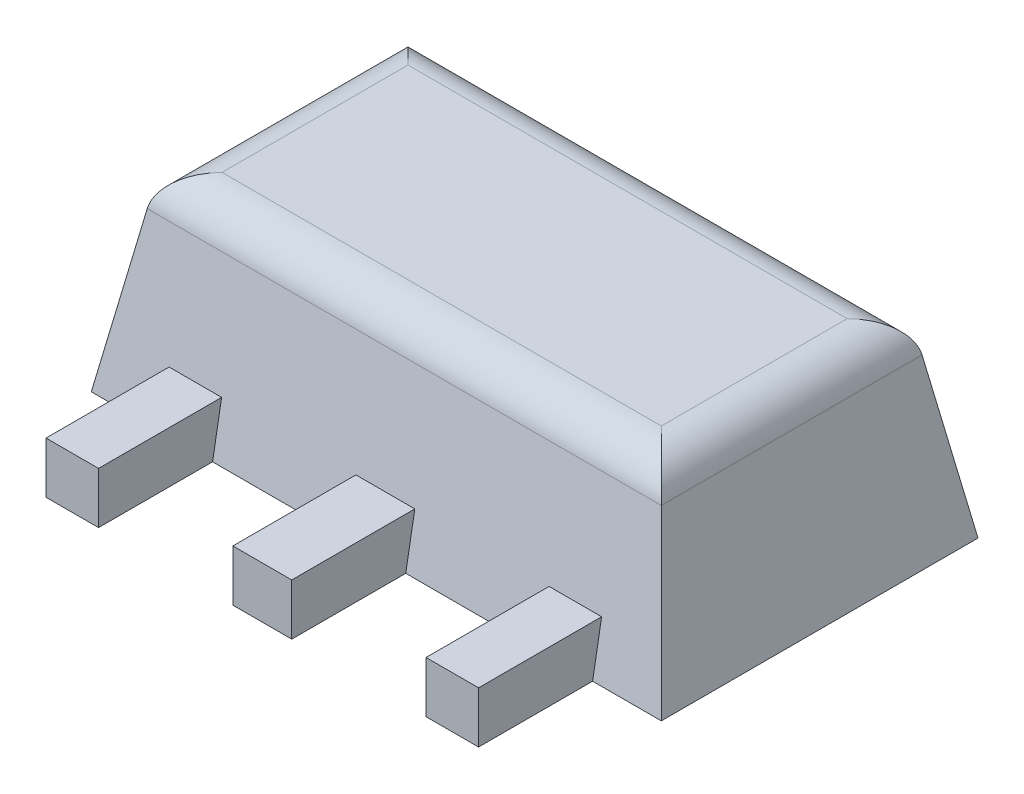
ISO-10303-21;
HEADER;
FILE_DESCRIPTION(('STEP AP214'),'2;1');
FILE_NAME('part.step','',(''),(''),'','','');
FILE_SCHEMA(('AUTOMOTIVE_DESIGN { 1 0 10303 214 1 1 1 1 }'));
ENDSEC;
DATA;
#1=APPLICATION_CONTEXT('core data for automotive mechanical design processes');
#2=APPLICATION_PROTOCOL_DEFINITION('international standard','automotive_design',2000,#1);
#3=PRODUCT_CONTEXT('',#1,'mechanical');
#4=PRODUCT('Part','Part','',(#3));
#5=PRODUCT_RELATED_PRODUCT_CATEGORY('part','',(#4));
#6=PRODUCT_DEFINITION_FORMATION('','',#4);
#7=PRODUCT_DEFINITION_CONTEXT('part definition',#1,'design');
#8=PRODUCT_DEFINITION('design','',#6,#7);
#9=PRODUCT_DEFINITION_SHAPE('','',#8);
#10=(LENGTH_UNIT() NAMED_UNIT(*) SI_UNIT(.MILLI.,.METRE.));
#11=(NAMED_UNIT(*) PLANE_ANGLE_UNIT() SI_UNIT($,.RADIAN.));
#12=(NAMED_UNIT(*) SI_UNIT($,.STERADIAN.) SOLID_ANGLE_UNIT());
#13=UNCERTAINTY_MEASURE_WITH_UNIT(LENGTH_MEASURE(1.E-05),#10,'distance_accuracy_value','');
#14=(GEOMETRIC_REPRESENTATION_CONTEXT(3) GLOBAL_UNCERTAINTY_ASSIGNED_CONTEXT((#13)) GLOBAL_UNIT_ASSIGNED_CONTEXT((#10,
#11,#12)) REPRESENTATION_CONTEXT('',''));
#15=CARTESIAN_POINT('',(0.,0.,0.));
#16=DIRECTION('',(0.,0.,1.));
#17=DIRECTION('',(1.,0.,0.));
#18=AXIS2_PLACEMENT_3D('',#15,#16,#17);
#19=CARTESIAN_POINT('',(-0.2075,1.5,0.45));
#20=DIRECTION('',(0.,0.,-1.));
#21=DIRECTION('',(-1.,0.,0.));
#22=AXIS2_PLACEMENT_3D('',#19,#20,#21);
#23=PLANE('',#22);
#24=DIRECTION('',(0.,-1.,0.));
#25=VECTOR('',#24,1.);
#26=CARTESIAN_POINT('',(0.2075,1.5,0.45));
#27=LINE('',#26,#25);
#28=CARTESIAN_POINT('',(0.2075,0.405,0.450000000000001));
#29=VERTEX_POINT('',#28);
#30=CARTESIAN_POINT('',(0.2075,0.,0.45));
#31=VERTEX_POINT('',#30);
#32=EDGE_CURVE('E241',#29,#31,#27,.T.);
#33=ORIENTED_EDGE('',*,*,#32,.F.);
#34=DIRECTION('',(1.,0.,0.));
#35=VECTOR('',#34,1.);
#36=CARTESIAN_POINT('',(-0.75,0.405,0.450000000000001));
#37=LINE('',#36,#35);
#38=CARTESIAN_POINT('',(-0.2075,0.405,0.450000000000001));
#39=VERTEX_POINT('',#38);
#40=EDGE_CURVE('E274',#39,#29,#37,.T.);
#41=ORIENTED_EDGE('',*,*,#40,.F.);
#42=DIRECTION('',(0.,-1.,0.));
#43=VECTOR('',#42,1.);
#44=CARTESIAN_POINT('',(-0.2075,1.5,0.45));
#45=LINE('',#44,#43);
#46=CARTESIAN_POINT('',(-0.2075,0.,0.45));
#47=VERTEX_POINT('',#46);
#48=EDGE_CURVE('E291',#39,#47,#45,.T.);
#49=ORIENTED_EDGE('',*,*,#48,.T.);
#50=DIRECTION('',(1.,0.,0.));
#51=VECTOR('',#50,1.);
#52=CARTESIAN_POINT('',(-0.2075,0.,0.45));
#53=LINE('',#52,#51);
#54=EDGE_CURVE('E421',#47,#31,#53,.T.);
#55=ORIENTED_EDGE('',*,*,#54,.T.);
#56=EDGE_LOOP('',(#33,#41,#49,#55));
#57=FACE_BOUND('',#56,.T.);
#58=ADVANCED_FACE('F33',(#57),#23,.F.);
#59=CARTESIAN_POINT('',(0.2075,1.5,0.45));
#60=DIRECTION('',(-1.,0.,0.));
#61=DIRECTION('',(0.,0.,1.));
#62=AXIS2_PLACEMENT_3D('',#59,#60,#61);
#63=PLANE('',#62);
#64=DIRECTION('',(0.,0.984807753012208,-0.173648177666931));
#65=VECTOR('',#64,1.);
#66=CARTESIAN_POINT('',(0.2075,1.30086040109288,-0.679376786847911));
#67=LINE('',#66,#65);
#68=CARTESIAN_POINT('',(0.2075,0.405,-0.521412427186928));
#69=VERTEX_POINT('',#68);
#70=CARTESIAN_POINT('',(0.2075,0.,-0.45));
#71=VERTEX_POINT('',#70);
#72=EDGE_CURVE('E244',#69,#71,#67,.F.);
#73=ORIENTED_EDGE('',*,*,#72,.F.);
#74=DIRECTION('',(0.,0.,1.));
#75=VECTOR('',#74,1.);
#76=CARTESIAN_POINT('',(0.2075,0.405,0.45));
#77=LINE('',#76,#75);
#78=EDGE_CURVE('E409',#69,#29,#77,.T.);
#79=ORIENTED_EDGE('',*,*,#78,.T.);
#80=ORIENTED_EDGE('',*,*,#32,.T.);
#81=DIRECTION('',(0.,0.,-1.));
#82=VECTOR('',#81,1.);
#83=CARTESIAN_POINT('',(0.2075,0.,0.45));
#84=LINE('',#83,#82);
#85=EDGE_CURVE('E457',#31,#71,#84,.T.);
#86=ORIENTED_EDGE('',*,*,#85,.T.);
#87=EDGE_LOOP('',(#73,#79,#80,#86));
#88=FACE_BOUND('',#87,.T.);
#89=ADVANCED_FACE('F360',(#88),#63,.F.);
#90=CARTESIAN_POINT('',(1.2675,1.5,-0.45));
#91=DIRECTION('',(1.,0.,0.));
#92=DIRECTION('',(0.,0.,-1.));
#93=AXIS2_PLACEMENT_3D('',#90,#91,#92);
#94=PLANE('',#93);
#95=DIRECTION('',(0.,-1.,0.));
#96=VECTOR('',#95,1.);
#97=CARTESIAN_POINT('',(1.2675,1.5,0.45));
#98=LINE('',#97,#96);
#99=CARTESIAN_POINT('',(1.2675,0.405,0.450000000000001));
#100=VERTEX_POINT('',#99);
#101=CARTESIAN_POINT('',(1.2675,0.,0.45));
#102=VERTEX_POINT('',#101);
#103=EDGE_CURVE('E237',#100,#102,#98,.T.);
#104=ORIENTED_EDGE('',*,*,#103,.F.);
#105=DIRECTION('',(0.,0.,-1.));
#106=VECTOR('',#105,1.);
#107=CARTESIAN_POINT('',(1.2675,0.405,-0.45));
#108=LINE('',#107,#106);
#109=CARTESIAN_POINT('',(1.2675,0.405,-0.521412427186928));
#110=VERTEX_POINT('',#109);
#111=EDGE_CURVE('E462',#100,#110,#108,.T.);
#112=ORIENTED_EDGE('',*,*,#111,.T.);
#113=DIRECTION('',(0.,0.984807753012208,-0.173648177666931));
#114=VECTOR('',#113,1.);
#115=CARTESIAN_POINT('',(1.2675,0.,-0.45));
#116=LINE('',#115,#114);
#117=CARTESIAN_POINT('',(1.2675,0.,-0.45));
#118=VERTEX_POINT('',#117);
#119=EDGE_CURVE('E240',#110,#118,#116,.F.);
#120=ORIENTED_EDGE('',*,*,#119,.T.);
#121=DIRECTION('',(0.,0.,1.));
#122=VECTOR('',#121,1.);
#123=CARTESIAN_POINT('',(1.2675,0.,-0.45));
#124=LINE('',#123,#122);
#125=EDGE_CURVE('E451',#118,#102,#124,.T.);
#126=ORIENTED_EDGE('',*,*,#125,.T.);
#127=EDGE_LOOP('',(#104,#112,#120,#126));
#128=FACE_BOUND('',#127,.T.);
#129=ADVANCED_FACE('F366',(#128),#94,.F.);
#130=CARTESIAN_POINT('',(1.2675,1.5,0.45));
#131=DIRECTION('',(0.,0.,-1.));
#132=DIRECTION('',(-1.,0.,0.));
#133=AXIS2_PLACEMENT_3D('',#130,#131,#132);
#134=PLANE('',#133);
#135=DIRECTION('',(0.,-1.,0.));
#136=VECTOR('',#135,1.);
#137=CARTESIAN_POINT('',(1.7325,1.5,0.45));
#138=LINE('',#137,#136);
#139=CARTESIAN_POINT('',(1.7325,0.405,0.45));
#140=VERTEX_POINT('',#139);
#141=CARTESIAN_POINT('',(1.7325,0.,0.45));
#142=VERTEX_POINT('',#141);
#143=EDGE_CURVE('E235',#140,#142,#138,.T.);
#144=ORIENTED_EDGE('',*,*,#143,.F.);
#145=EDGE_CURVE('E475',#100,#140,#37,.T.);
#146=ORIENTED_EDGE('',*,*,#145,.F.);
#147=ORIENTED_EDGE('',*,*,#103,.T.);
#148=DIRECTION('',(1.,0.,0.));
#149=VECTOR('',#148,1.);
#150=CARTESIAN_POINT('',(1.2675,0.,0.45));
#151=LINE('',#150,#149);
#152=EDGE_CURVE('E448',#102,#142,#151,.T.);
#153=ORIENTED_EDGE('',*,*,#152,.T.);
#154=EDGE_LOOP('',(#144,#146,#147,#153));
#155=FACE_BOUND('',#154,.T.);
#156=ADVANCED_FACE('F517',(#155),#134,.F.);
#157=CARTESIAN_POINT('',(1.7325,1.5,-0.45));
#158=DIRECTION('',(-1.,0.,0.));
#159=DIRECTION('',(0.,0.,1.));
#160=AXIS2_PLACEMENT_3D('',#157,#158,#159);
#161=PLANE('',#160);
#162=DIRECTION('',(0.,0.984807753012208,-0.173648177666931));
#163=VECTOR('',#162,1.);
#164=CARTESIAN_POINT('',(1.7325,1.45476946558943,-0.706515107494252));
#165=LINE('',#164,#163);
#166=CARTESIAN_POINT('',(1.7325,0.405,-0.521412427186928));
#167=VERTEX_POINT('',#166);
#168=CARTESIAN_POINT('',(1.7325,0.,-0.45));
#169=VERTEX_POINT('',#168);
#170=EDGE_CURVE('E238',#167,#169,#165,.F.);
#171=ORIENTED_EDGE('',*,*,#170,.F.);
#172=DIRECTION('',(0.,0.,1.));
#173=VECTOR('',#172,1.);
#174=CARTESIAN_POINT('',(1.7325,0.405,-0.45));
#175=LINE('',#174,#173);
#176=EDGE_CURVE('E465',#167,#140,#175,.T.);
#177=ORIENTED_EDGE('',*,*,#176,.T.);
#178=ORIENTED_EDGE('',*,*,#143,.T.);
#179=DIRECTION('',(0.,0.,-1.));
#180=VECTOR('',#179,1.);
#181=CARTESIAN_POINT('',(1.7325,0.,-0.45));
#182=LINE('',#181,#180);
#183=EDGE_CURVE('E280',#142,#169,#182,.T.);
#184=ORIENTED_EDGE('',*,*,#183,.T.);
#185=EDGE_LOOP('',(#171,#177,#178,#184));
#186=FACE_BOUND('',#185,.T.);
#187=ADVANCED_FACE('F511',(#186),#161,.F.);
#188=CARTESIAN_POINT('',(2.7925,1.5,0.45));
#189=DIRECTION('',(1.,0.,0.));
#190=DIRECTION('',(0.,0.,-1.));
#191=AXIS2_PLACEMENT_3D('',#188,#189,#190);
#192=PLANE('',#191);
#193=DIRECTION('',(0.,-1.,0.));
#194=VECTOR('',#193,1.);
#195=CARTESIAN_POINT('',(2.7925,1.5,0.45));
#196=LINE('',#195,#194);
#197=CARTESIAN_POINT('',(2.7925,0.405,0.45));
#198=VERTEX_POINT('',#197);
#199=CARTESIAN_POINT('',(2.7925,0.,0.45));
#200=VERTEX_POINT('',#199);
#201=EDGE_CURVE('E231',#198,#200,#196,.T.);
#202=ORIENTED_EDGE('',*,*,#201,.F.);
#203=DIRECTION('',(0.,0.,-1.));
#204=VECTOR('',#203,1.);
#205=CARTESIAN_POINT('',(2.7925,0.405,0.45));
#206=LINE('',#205,#204);
#207=CARTESIAN_POINT('',(2.7925,0.405,-0.521412427186928));
#208=VERTEX_POINT('',#207);
#209=EDGE_CURVE('E468',#198,#208,#206,.T.);
#210=ORIENTED_EDGE('',*,*,#209,.T.);
#211=DIRECTION('',(0.,0.984807753012208,-0.173648177666931));
#212=VECTOR('',#211,1.);
#213=CARTESIAN_POINT('',(2.7925,0.,-0.45));
#214=LINE('',#213,#212);
#215=CARTESIAN_POINT('',(2.7925,0.,-0.45));
#216=VERTEX_POINT('',#215);
#217=EDGE_CURVE('E234',#208,#216,#214,.F.);
#218=ORIENTED_EDGE('',*,*,#217,.T.);
#219=DIRECTION('',(0.,0.,1.));
#220=VECTOR('',#219,1.);
#221=CARTESIAN_POINT('',(2.7925,0.,0.45));
#222=LINE('',#221,#220);
#223=EDGE_CURVE('E279',#216,#200,#222,.T.);
#224=ORIENTED_EDGE('',*,*,#223,.T.);
#225=EDGE_LOOP('',(#202,#210,#218,#224));
#226=FACE_BOUND('',#225,.T.);
#227=ADVANCED_FACE('F507',(#226),#192,.F.);
#228=CARTESIAN_POINT('',(3.2075,1.5,0.45));
#229=DIRECTION('',(0.,0.,-1.));
#230=DIRECTION('',(-1.,0.,0.));
#231=AXIS2_PLACEMENT_3D('',#228,#229,#230);
#232=PLANE('',#231);
#233=DIRECTION('',(0.,-1.,0.));
#234=VECTOR('',#233,1.);
#235=CARTESIAN_POINT('',(3.2075,1.5,0.45));
#236=LINE('',#235,#234);
#237=CARTESIAN_POINT('',(3.2075,0.405,0.45));
#238=VERTEX_POINT('',#237);
#239=CARTESIAN_POINT('',(3.2075,0.,0.45));
#240=VERTEX_POINT('',#239);
#241=EDGE_CURVE('E229',#238,#240,#236,.T.);
#242=ORIENTED_EDGE('',*,*,#241,.F.);
#243=EDGE_CURVE('E473',#198,#238,#37,.T.);
#244=ORIENTED_EDGE('',*,*,#243,.F.);
#245=ORIENTED_EDGE('',*,*,#201,.T.);
#246=DIRECTION('',(1.,0.,0.));
#247=VECTOR('',#246,1.);
#248=CARTESIAN_POINT('',(3.2075,0.,0.45));
#249=LINE('',#248,#247);
#250=EDGE_CURVE('E441',#200,#240,#249,.T.);
#251=ORIENTED_EDGE('',*,*,#250,.T.);
#252=EDGE_LOOP('',(#242,#244,#245,#251));
#253=FACE_BOUND('',#252,.T.);
#254=ADVANCED_FACE('F501',(#253),#232,.F.);
#255=CARTESIAN_POINT('',(3.2075,1.5,0.45));
#256=DIRECTION('',(-1.,0.,0.));
#257=DIRECTION('',(0.,0.,1.));
#258=AXIS2_PLACEMENT_3D('',#255,#256,#257);
#259=PLANE('',#258);
#260=DIRECTION('',(0.,0.984807753012208,-0.173648177666931));
#261=VECTOR('',#260,1.);
#262=CARTESIAN_POINT('',(3.2075,1.30086040109288,-0.679376786847911));
#263=LINE('',#262,#261);
#264=CARTESIAN_POINT('',(3.2075,0.405,-0.521412427186929));
#265=VERTEX_POINT('',#264);
#266=CARTESIAN_POINT('',(3.2075,0.,-0.45));
#267=VERTEX_POINT('',#266);
#268=EDGE_CURVE('E232',#265,#267,#263,.F.);
#269=ORIENTED_EDGE('',*,*,#268,.F.);
#270=DIRECTION('',(0.,0.,1.));
#271=VECTOR('',#270,1.);
#272=CARTESIAN_POINT('',(3.2075,0.405,0.45));
#273=LINE('',#272,#271);
#274=EDGE_CURVE('E289',#265,#238,#273,.T.);
#275=ORIENTED_EDGE('',*,*,#274,.T.);
#276=ORIENTED_EDGE('',*,*,#241,.T.);
#277=DIRECTION('',(0.,0.,-1.));
#278=VECTOR('',#277,1.);
#279=CARTESIAN_POINT('',(3.2075,0.,0.45));
#280=LINE('',#279,#278);
#281=EDGE_CURVE('E268',#240,#267,#280,.T.);
#282=ORIENTED_EDGE('',*,*,#281,.T.);
#283=EDGE_LOOP('',(#269,#275,#276,#282));
#284=FACE_BOUND('',#283,.T.);
#285=ADVANCED_FACE('F381',(#284),#259,.F.);
#286=CARTESIAN_POINT('',(3.75,0.,-0.45));
#287=DIRECTION('',(0.984807753012208,0.173648177666931,0.));
#288=DIRECTION('',(-0.173648177666931,0.984807753012208,0.));
#289=AXIS2_PLACEMENT_3D('',#286,#287,#288);
#290=PLANE('',#289);
#291=DIRECTION('',(0.171087869746036,-0.970287525247814,-0.171087869746036));
#292=VECTOR('',#291,1.);
#293=CARTESIAN_POINT('',(3.61828023371594,0.747019915811106,-2.81828023371594));
#294=LINE('',#293,#292);
#295=CARTESIAN_POINT('',(3.52922196548778,1.25209445330008,-2.72922196548778));
#296=VERTEX_POINT('',#295);
#297=CARTESIAN_POINT('',(3.75,0.,-2.95));
#298=VERTEX_POINT('',#297);
#299=EDGE_CURVE('E253',#296,#298,#294,.T.);
#300=ORIENTED_EDGE('',*,*,#299,.F.);
#301=DIRECTION('',(0.,0.,-1.));
#302=VECTOR('',#301,1.);
#303=CARTESIAN_POINT('',(3.52922196548778,1.25209445330008,-0.714490471062698));
#304=LINE('',#303,#302);
#305=CARTESIAN_POINT('',(3.52922196548778,1.25209445330008,-0.67077803451222));
#306=VERTEX_POINT('',#305);
#307=EDGE_CURVE('E305',#296,#306,#304,.F.);
#308=ORIENTED_EDGE('',*,*,#307,.T.);
#309=DIRECTION('',(0.171087869746036,-0.970287525247814,0.171087869746036));
#310=VECTOR('',#309,1.);
#311=CARTESIAN_POINT('',(3.75,0.,-0.45));
#312=LINE('',#311,#310);
#313=CARTESIAN_POINT('',(3.75,0.,-0.45));
#314=VERTEX_POINT('',#313);
#315=EDGE_CURVE('E255',#306,#314,#312,.T.);
#316=ORIENTED_EDGE('',*,*,#315,.T.);
#317=DIRECTION('',(0.,0.,-1.));
#318=VECTOR('',#317,1.);
#319=CARTESIAN_POINT('',(3.75,0.,-0.45));
#320=LINE('',#319,#318);
#321=EDGE_CURVE('E264',#314,#298,#320,.T.);
#322=ORIENTED_EDGE('',*,*,#321,.T.);
#323=EDGE_LOOP('',(#300,#308,#316,#322));
#324=FACE_BOUND('',#323,.T.);
#325=ADVANCED_FACE('F336',(#324),#290,.T.);
#326=CARTESIAN_POINT('',(2.3,1.5,-2.95));
#327=DIRECTION('',(-1.,0.,0.));
#328=DIRECTION('',(0.,0.,1.));
#329=AXIS2_PLACEMENT_3D('',#326,#327,#328);
#330=PLANE('',#329);
#331=DIRECTION('',(0.,-1.,0.));
#332=VECTOR('',#331,1.);
#333=CARTESIAN_POINT('',(2.3,1.5,-3.3));
#334=LINE('',#333,#332);
#335=CARTESIAN_POINT('',(2.3,0.405,-3.3));
#336=VERTEX_POINT('',#335);
#337=CARTESIAN_POINT('',(2.3,0.,-3.3));
#338=VERTEX_POINT('',#337);
#339=EDGE_CURVE('E221',#336,#338,#334,.T.);
#340=ORIENTED_EDGE('',*,*,#339,.F.);
#341=DIRECTION('',(0.,0.,1.));
#342=VECTOR('',#341,1.);
#343=CARTESIAN_POINT('',(2.3,0.405,-2.95));
#344=LINE('',#343,#342);
#345=CARTESIAN_POINT('',(2.3,0.405,-2.87858757281307));
#346=VERTEX_POINT('',#345);
#347=EDGE_CURVE('E476',#336,#346,#344,.T.);
#348=ORIENTED_EDGE('',*,*,#347,.T.);
#349=DIRECTION('',(0.,0.984807753012208,0.173648177666931));
#350=VECTOR('',#349,1.);
#351=CARTESIAN_POINT('',(2.3,0.,-2.95));
#352=LINE('',#351,#350);
#353=CARTESIAN_POINT('',(2.3,0.,-2.95));
#354=VERTEX_POINT('',#353);
#355=EDGE_CURVE('E228',#346,#354,#352,.F.);
#356=ORIENTED_EDGE('',*,*,#355,.T.);
#357=DIRECTION('',(0.,0.,-1.));
#358=VECTOR('',#357,1.);
#359=CARTESIAN_POINT('',(2.3,0.,-2.95));
#360=LINE('',#359,#358);
#361=EDGE_CURVE('E263',#354,#338,#360,.T.);
#362=ORIENTED_EDGE('',*,*,#361,.T.);
#363=EDGE_LOOP('',(#340,#348,#356,#362));
#364=FACE_BOUND('',#363,.T.);
#365=ADVANCED_FACE('F380',(#364),#330,.F.);
#366=CARTESIAN_POINT('',(2.3,1.5,-3.3));
#367=DIRECTION('',(-0.707106781186547,0.,0.707106781186548));
#368=DIRECTION('',(0.707106781186548,0.,0.707106781186547));
#369=AXIS2_PLACEMENT_3D('',#366,#367,#368);
#370=PLANE('',#369);
#371=DIRECTION('',(0.,-1.,0.));
#372=VECTOR('',#371,1.);
#373=CARTESIAN_POINT('',(2.05,1.5,-3.55));
#374=LINE('',#373,#372);
#375=CARTESIAN_POINT('',(2.05,0.405,-3.55));
#376=VERTEX_POINT('',#375);
#377=CARTESIAN_POINT('',(2.05,0.,-3.55));
#378=VERTEX_POINT('',#377);
#379=EDGE_CURVE('E219',#376,#378,#374,.T.);
#380=ORIENTED_EDGE('',*,*,#379,.F.);
#381=DIRECTION('',(0.707106781186548,0.,0.707106781186547));
#382=VECTOR('',#381,1.);
#383=CARTESIAN_POINT('',(2.3,0.405,-3.3));
#384=LINE('',#383,#382);
#385=EDGE_CURVE('E200',#376,#336,#384,.T.);
#386=ORIENTED_EDGE('',*,*,#385,.T.);
#387=ORIENTED_EDGE('',*,*,#339,.T.);
#388=DIRECTION('',(-0.707106781186548,0.,-0.707106781186547));
#389=VECTOR('',#388,1.);
#390=CARTESIAN_POINT('',(2.3,0.,-3.3));
#391=LINE('',#390,#389);
#392=EDGE_CURVE('E433',#338,#378,#391,.T.);
#393=ORIENTED_EDGE('',*,*,#392,.T.);
#394=EDGE_LOOP('',(#380,#386,#387,#393));
#395=FACE_BOUND('',#394,.T.);
#396=ADVANCED_FACE('F489',(#395),#370,.F.);
#397=CARTESIAN_POINT('',(0.95,1.5,-3.55));
#398=DIRECTION('',(0.,0.,1.));
#399=DIRECTION('',(1.,0.,0.));
#400=AXIS2_PLACEMENT_3D('',#397,#398,#399);
#401=PLANE('',#400);
#402=DIRECTION('',(0.,-1.,0.));
#403=VECTOR('',#402,1.);
#404=CARTESIAN_POINT('',(0.95,1.5,-3.55));
#405=LINE('',#404,#403);
#406=CARTESIAN_POINT('',(0.949999999999999,0.405,-3.55));
#407=VERTEX_POINT('',#406);
#408=CARTESIAN_POINT('',(0.95,0.,-3.55));
#409=VERTEX_POINT('',#408);
#410=EDGE_CURVE('E211',#407,#409,#405,.T.);
#411=ORIENTED_EDGE('',*,*,#410,.F.);
#412=DIRECTION('',(1.,0.,0.));
#413=VECTOR('',#412,1.);
#414=CARTESIAN_POINT('',(-0.750000000000001,0.405,-3.55));
#415=LINE('',#414,#413);
#416=EDGE_CURVE('E194',#407,#376,#415,.T.);
#417=ORIENTED_EDGE('',*,*,#416,.T.);
#418=ORIENTED_EDGE('',*,*,#379,.T.);
#419=DIRECTION('',(-1.,0.,0.));
#420=VECTOR('',#419,1.);
#421=CARTESIAN_POINT('',(0.95,0.,-3.55));
#422=LINE('',#421,#420);
#423=EDGE_CURVE('E217',#378,#409,#422,.T.);
#424=ORIENTED_EDGE('',*,*,#423,.T.);
#425=EDGE_LOOP('',(#411,#417,#418,#424));
#426=FACE_BOUND('',#425,.T.);
#427=ADVANCED_FACE('F215',(#426),#401,.F.);
#428=CARTESIAN_POINT('',(0.7,1.5,-3.3));
#429=DIRECTION('',(0.707106781186547,0.,0.707106781186548));
#430=DIRECTION('',(0.707106781186548,0.,-0.707106781186547));
#431=AXIS2_PLACEMENT_3D('',#428,#429,#430);
#432=PLANE('',#431);
#433=DIRECTION('',(0.,-1.,0.));
#434=VECTOR('',#433,1.);
#435=CARTESIAN_POINT('',(0.7,1.5,-3.3));
#436=LINE('',#435,#434);
#437=CARTESIAN_POINT('',(0.7,0.405,-3.3));
#438=VERTEX_POINT('',#437);
#439=CARTESIAN_POINT('',(0.7,0.,-3.3));
#440=VERTEX_POINT('',#439);
#441=EDGE_CURVE('E213',#438,#440,#436,.T.);
#442=ORIENTED_EDGE('',*,*,#441,.F.);
#443=DIRECTION('',(0.707106781186548,0.,-0.707106781186547));
#444=VECTOR('',#443,1.);
#445=CARTESIAN_POINT('',(0.7,0.405,-3.3));
#446=LINE('',#445,#444);
#447=EDGE_CURVE('E197',#438,#407,#446,.T.);
#448=ORIENTED_EDGE('',*,*,#447,.T.);
#449=ORIENTED_EDGE('',*,*,#410,.T.);
#450=DIRECTION('',(-0.707106781186548,0.,0.707106781186547));
#451=VECTOR('',#450,1.);
#452=CARTESIAN_POINT('',(0.7,0.,-3.3));
#453=LINE('',#452,#451);
#454=EDGE_CURVE('E430',#409,#440,#453,.T.);
#455=ORIENTED_EDGE('',*,*,#454,.T.);
#456=EDGE_LOOP('',(#442,#448,#449,#455));
#457=FACE_BOUND('',#456,.T.);
#458=ADVANCED_FACE('F209',(#457),#432,.F.);
#459=CARTESIAN_POINT('',(0.7,1.5,-2.95));
#460=DIRECTION('',(1.,0.,0.));
#461=DIRECTION('',(0.,0.,-1.));
#462=AXIS2_PLACEMENT_3D('',#459,#460,#461);
#463=PLANE('',#462);
#464=DIRECTION('',(0.,0.984807753012208,0.173648177666931));
#465=VECTOR('',#464,1.);
#466=CARTESIAN_POINT('',(0.7,1.45476946558943,-2.69348489250575));
#467=LINE('',#466,#465);
#468=CARTESIAN_POINT('',(0.7,0.405,-2.87858757281307));
#469=VERTEX_POINT('',#468);
#470=CARTESIAN_POINT('',(0.7,0.,-2.95));
#471=VERTEX_POINT('',#470);
#472=EDGE_CURVE('E223',#469,#471,#467,.F.);
#473=ORIENTED_EDGE('',*,*,#472,.F.);
#474=DIRECTION('',(0.,0.,-1.));
#475=VECTOR('',#474,1.);
#476=CARTESIAN_POINT('',(0.7,0.405,-2.95));
#477=LINE('',#476,#475);
#478=EDGE_CURVE('E204',#469,#438,#477,.T.);
#479=ORIENTED_EDGE('',*,*,#478,.T.);
#480=ORIENTED_EDGE('',*,*,#441,.T.);
#481=DIRECTION('',(0.,0.,1.));
#482=VECTOR('',#481,1.);
#483=CARTESIAN_POINT('',(0.7,0.,-2.95));
#484=LINE('',#483,#482);
#485=EDGE_CURVE('E427',#440,#471,#484,.T.);
#486=ORIENTED_EDGE('',*,*,#485,.T.);
#487=EDGE_LOOP('',(#473,#479,#480,#486));
#488=FACE_BOUND('',#487,.T.);
#489=ADVANCED_FACE('F377',(#488),#463,.F.);
#490=CARTESIAN_POINT('',(-0.75,0.,-2.95));
#491=DIRECTION('',(0.,0.173648177666931,-0.984807753012208));
#492=DIRECTION('',(0.,0.984807753012208,0.173648177666931));
#493=AXIS2_PLACEMENT_3D('',#490,#491,#492);
#494=PLANE('',#493);
#495=DIRECTION('',(-0.171087869746036,-0.970287525247814,-0.171087869746036));
#496=VECTOR('',#495,1.);
#497=CARTESIAN_POINT('',(-0.676822352064409,0.415011064339503,-2.87682235206441));
#498=LINE('',#497,#496);
#499=CARTESIAN_POINT('',(-0.52922196548778,1.25209445330008,-2.72922196548778));
#500=VERTEX_POINT('',#499);
#501=CARTESIAN_POINT('',(-0.75,0.,-2.95));
#502=VERTEX_POINT('',#501);
#503=EDGE_CURVE('E250',#500,#502,#498,.T.);
#504=ORIENTED_EDGE('',*,*,#503,.F.);
#505=DIRECTION('',(-1.,0.,0.));
#506=VECTOR('',#505,1.);
#507=CARTESIAN_POINT('',(3.4855095289373,1.25209445330008,-2.72922196548778));
#508=LINE('',#507,#506);
#509=EDGE_CURVE('E11',#500,#296,#508,.F.);
#510=ORIENTED_EDGE('',*,*,#509,.T.);
#511=ORIENTED_EDGE('',*,*,#299,.T.);
#512=DIRECTION('',(1.,0.,0.));
#513=VECTOR('',#512,1.);
#514=CARTESIAN_POINT('',(-0.75,0.,-2.95));
#515=LINE('',#514,#513);
#516=EDGE_CURVE('E260',#298,#354,#515,.F.);
#517=ORIENTED_EDGE('',*,*,#516,.T.);
#518=ORIENTED_EDGE('',*,*,#355,.F.);
#519=DIRECTION('',(-1.,0.,0.));
#520=VECTOR('',#519,1.);
#521=CARTESIAN_POINT('',(-0.75,0.405,-2.87858757281307));
#522=LINE('',#521,#520);
#523=EDGE_CURVE('E205',#469,#346,#522,.F.);
#524=ORIENTED_EDGE('',*,*,#523,.F.);
#525=ORIENTED_EDGE('',*,*,#472,.T.);
#526=DIRECTION('',(-1.,0.,0.));
#527=VECTOR('',#526,1.);
#528=CARTESIAN_POINT('',(-0.75,0.,-2.95));
#529=LINE('',#528,#527);
#530=EDGE_CURVE('E425',#471,#502,#529,.T.);
#531=ORIENTED_EDGE('',*,*,#530,.T.);
#532=EDGE_LOOP('',(#504,#510,#511,#517,#518,#524,#525,#531));
#533=FACE_BOUND('',#532,.T.);
#534=ADVANCED_FACE('F331',(#533),#494,.T.);
#535=CARTESIAN_POINT('',(-0.75,0.,-0.45));
#536=DIRECTION('',(-0.984807753012208,0.173648177666931,0.));
#537=DIRECTION('',(-0.173648177666931,-0.984807753012208,0.));
#538=AXIS2_PLACEMENT_3D('',#535,#536,#537);
#539=PLANE('',#538);
#540=DIRECTION('',(-0.171087869746036,-0.970287525247814,0.171087869746036));
#541=VECTOR('',#540,1.);
#542=CARTESIAN_POINT('',(-0.721972960840669,0.15894923764203,-0.478027039159331));
#543=LINE('',#542,#541);
#544=CARTESIAN_POINT('',(-0.529221965487781,1.25209445330008,-0.670778034512219));
#545=VERTEX_POINT('',#544);
#546=CARTESIAN_POINT('',(-0.75,0.,-0.45));
#547=VERTEX_POINT('',#546);
#548=EDGE_CURVE('E248',#545,#547,#543,.T.);
#549=ORIENTED_EDGE('',*,*,#548,.F.);
#550=DIRECTION('',(0.,0.,1.));
#551=VECTOR('',#550,1.);
#552=CARTESIAN_POINT('',(-0.52922196548778,1.25209445330008,-2.6855095289373));
#553=LINE('',#552,#551);
#554=EDGE_CURVE('E42',#545,#500,#553,.F.);
#555=ORIENTED_EDGE('',*,*,#554,.T.);
#556=ORIENTED_EDGE('',*,*,#503,.T.);
#557=DIRECTION('',(0.,0.,1.));
#558=VECTOR('',#557,1.);
#559=CARTESIAN_POINT('',(-0.75,0.,-0.45));
#560=LINE('',#559,#558);
#561=EDGE_CURVE('E296',#502,#547,#560,.T.);
#562=ORIENTED_EDGE('',*,*,#561,.T.);
#563=EDGE_LOOP('',(#549,#555,#556,#562));
#564=FACE_BOUND('',#563,.T.);
#565=ADVANCED_FACE('F372',(#564),#539,.T.);
#566=CARTESIAN_POINT('',(0.2075,0.,-0.45));
#567=DIRECTION('',(0.,0.173648177666931,0.984807753012208));
#568=DIRECTION('',(0.,-0.984807753012208,0.173648177666931));
#569=AXIS2_PLACEMENT_3D('',#566,#567,#568);
#570=PLANE('',#569);
#571=ORIENTED_EDGE('',*,*,#315,.F.);
#572=DIRECTION('',(1.,0.,0.));
#573=VECTOR('',#572,1.);
#574=CARTESIAN_POINT('',(-0.485509528937302,1.25209445330008,-0.67077803451222));
#575=LINE('',#574,#573);
#576=EDGE_CURVE('E57',#306,#545,#575,.F.);
#577=ORIENTED_EDGE('',*,*,#576,.T.);
#578=ORIENTED_EDGE('',*,*,#548,.T.);
#579=DIRECTION('',(-1.,0.,0.));
#580=VECTOR('',#579,1.);
#581=CARTESIAN_POINT('',(0.2075,0.,-0.45));
#582=LINE('',#581,#580);
#583=CARTESIAN_POINT('',(-0.2075,0.,-0.45));
#584=VERTEX_POINT('',#583);
#585=EDGE_CURVE('E292',#547,#584,#582,.F.);
#586=ORIENTED_EDGE('',*,*,#585,.T.);
#587=DIRECTION('',(0.,0.984807753012208,-0.173648177666931));
#588=VECTOR('',#587,1.);
#589=CARTESIAN_POINT('',(-0.2075,0.,-0.45));
#590=LINE('',#589,#588);
#591=CARTESIAN_POINT('',(-0.2075,0.405,-0.521412427186928));
#592=VERTEX_POINT('',#591);
#593=EDGE_CURVE('E251',#592,#584,#590,.F.);
#594=ORIENTED_EDGE('',*,*,#593,.F.);
#595=DIRECTION('',(-1.,0.,0.));
#596=VECTOR('',#595,1.);
#597=CARTESIAN_POINT('',(-0.75,0.405,-0.521412427186928));
#598=LINE('',#597,#596);
#599=EDGE_CURVE('E284',#592,#69,#598,.F.);
#600=ORIENTED_EDGE('',*,*,#599,.T.);
#601=ORIENTED_EDGE('',*,*,#72,.T.);
#602=DIRECTION('',(1.,0.,0.));
#603=VECTOR('',#602,1.);
#604=CARTESIAN_POINT('',(0.2075,0.,-0.45));
#605=LINE('',#604,#603);
#606=EDGE_CURVE('E454',#71,#118,#605,.T.);
#607=ORIENTED_EDGE('',*,*,#606,.T.);
#608=ORIENTED_EDGE('',*,*,#119,.F.);
#609=DIRECTION('',(-1.,0.,0.));
#610=VECTOR('',#609,1.);
#611=CARTESIAN_POINT('',(-0.75,0.405,-0.521412427186928));
#612=LINE('',#611,#610);
#613=EDGE_CURVE('E273',#110,#167,#612,.F.);
#614=ORIENTED_EDGE('',*,*,#613,.T.);
#615=ORIENTED_EDGE('',*,*,#170,.T.);
#616=DIRECTION('',(-1.,0.,0.));
#617=VECTOR('',#616,1.);
#618=CARTESIAN_POINT('',(0.2075,0.,-0.45));
#619=LINE('',#618,#617);
#620=EDGE_CURVE('E276',#169,#216,#619,.F.);
#621=ORIENTED_EDGE('',*,*,#620,.T.);
#622=ORIENTED_EDGE('',*,*,#217,.F.);
#623=DIRECTION('',(-1.,0.,0.));
#624=VECTOR('',#623,1.);
#625=CARTESIAN_POINT('',(-0.75,0.405,-0.521412427186928));
#626=LINE('',#625,#624);
#627=EDGE_CURVE('E270',#208,#265,#626,.F.);
#628=ORIENTED_EDGE('',*,*,#627,.T.);
#629=ORIENTED_EDGE('',*,*,#268,.T.);
#630=DIRECTION('',(-1.,0.,0.));
#631=VECTOR('',#630,1.);
#632=CARTESIAN_POINT('',(0.2075,0.,-0.45));
#633=LINE('',#632,#631);
#634=EDGE_CURVE('E265',#267,#314,#633,.F.);
#635=ORIENTED_EDGE('',*,*,#634,.T.);
#636=EDGE_LOOP('',(#571,#577,#578,#586,#594,#600,#601,#607,#608,#614,#615,#621,#622,#628,#629,#635));
#637=FACE_BOUND('',#636,.T.);
#638=ADVANCED_FACE('F355',(#637),#570,.T.);
#639=CARTESIAN_POINT('',(-0.2075,1.5,0.45));
#640=DIRECTION('',(1.,0.,0.));
#641=DIRECTION('',(0.,0.,-1.));
#642=AXIS2_PLACEMENT_3D('',#639,#640,#641);
#643=PLANE('',#642);
#644=ORIENTED_EDGE('',*,*,#48,.F.);
#645=DIRECTION('',(0.,0.,-1.));
#646=VECTOR('',#645,1.);
#647=CARTESIAN_POINT('',(-0.2075,0.405,0.45));
#648=LINE('',#647,#646);
#649=EDGE_CURVE('E243',#39,#592,#648,.T.);
#650=ORIENTED_EDGE('',*,*,#649,.T.);
#651=ORIENTED_EDGE('',*,*,#593,.T.);
#652=DIRECTION('',(0.,0.,1.));
#653=VECTOR('',#652,1.);
#654=CARTESIAN_POINT('',(-0.2075,0.,0.45));
#655=LINE('',#654,#653);
#656=EDGE_CURVE('E295',#584,#47,#655,.T.);
#657=ORIENTED_EDGE('',*,*,#656,.T.);
#658=EDGE_LOOP('',(#644,#650,#651,#657));
#659=FACE_BOUND('',#658,.T.);
#660=ADVANCED_FACE('F346',(#659),#643,.F.);
#661=CARTESIAN_POINT('',(0.2075,1.5,0.45));
#662=DIRECTION('',(0.,1.,0.));
#663=DIRECTION('',(0.,0.,1.));
#664=AXIS2_PLACEMENT_3D('',#661,#662,#663);
#665=PLANE('',#664);
#666=DIRECTION('',(-1.,0.,0.));
#667=VECTOR('',#666,1.);
#668=CARTESIAN_POINT('',(3.4855095289373,1.5,-0.966220360415882));
#669=LINE('',#668,#667);
#670=CARTESIAN_POINT('',(-0.233779639584118,1.5,-0.966220360415882));
#671=VERTEX_POINT('',#670);
#672=CARTESIAN_POINT('',(3.23377963958412,1.5,-0.966220360415882));
#673=VERTEX_POINT('',#672);
#674=EDGE_CURVE('E300',#671,#673,#669,.F.);
#675=ORIENTED_EDGE('',*,*,#674,.T.);
#676=DIRECTION('',(0.,0.,1.));
#677=VECTOR('',#676,1.);
#678=CARTESIAN_POINT('',(3.23377963958412,1.5,-2.6855095289373));
#679=LINE('',#678,#677);
#680=CARTESIAN_POINT('',(3.23377963958412,1.5,-2.43377963958412));
#681=VERTEX_POINT('',#680);
#682=EDGE_CURVE('E302',#673,#681,#679,.F.);
#683=ORIENTED_EDGE('',*,*,#682,.T.);
#684=DIRECTION('',(1.,0.,0.));
#685=VECTOR('',#684,1.);
#686=CARTESIAN_POINT('',(-0.485509528937302,1.5,-2.43377963958412));
#687=LINE('',#686,#685);
#688=CARTESIAN_POINT('',(-0.233779639584118,1.5,-2.43377963958412));
#689=VERTEX_POINT('',#688);
#690=EDGE_CURVE('E247',#681,#689,#687,.F.);
#691=ORIENTED_EDGE('',*,*,#690,.T.);
#692=DIRECTION('',(0.,0.,-1.));
#693=VECTOR('',#692,1.);
#694=CARTESIAN_POINT('',(-0.233779639584118,1.5,-0.714490471062698));
#695=LINE('',#694,#693);
#696=EDGE_CURVE('E298',#689,#671,#695,.F.);
#697=ORIENTED_EDGE('',*,*,#696,.T.);
#698=EDGE_LOOP('',(#675,#683,#691,#697));
#699=FACE_BOUND('',#698,.T.);
#700=ADVANCED_FACE('F343',(#699),#665,.T.);
#701=CARTESIAN_POINT('',(0.2075,0.,0.45));
#702=DIRECTION('',(0.,1.,0.));
#703=DIRECTION('',(0.,0.,1.));
#704=AXIS2_PLACEMENT_3D('',#701,#702,#703);
#705=PLANE('',#704);
#706=ORIENTED_EDGE('',*,*,#54,.F.);
#707=ORIENTED_EDGE('',*,*,#656,.F.);
#708=ORIENTED_EDGE('',*,*,#585,.F.);
#709=ORIENTED_EDGE('',*,*,#561,.F.);
#710=ORIENTED_EDGE('',*,*,#530,.F.);
#711=ORIENTED_EDGE('',*,*,#485,.F.);
#712=ORIENTED_EDGE('',*,*,#454,.F.);
#713=ORIENTED_EDGE('',*,*,#423,.F.);
#714=ORIENTED_EDGE('',*,*,#392,.F.);
#715=ORIENTED_EDGE('',*,*,#361,.F.);
#716=ORIENTED_EDGE('',*,*,#516,.F.);
#717=ORIENTED_EDGE('',*,*,#321,.F.);
#718=ORIENTED_EDGE('',*,*,#634,.F.);
#719=ORIENTED_EDGE('',*,*,#281,.F.);
#720=ORIENTED_EDGE('',*,*,#250,.F.);
#721=ORIENTED_EDGE('',*,*,#223,.F.);
#722=ORIENTED_EDGE('',*,*,#620,.F.);
#723=ORIENTED_EDGE('',*,*,#183,.F.);
#724=ORIENTED_EDGE('',*,*,#152,.F.);
#725=ORIENTED_EDGE('',*,*,#125,.F.);
#726=ORIENTED_EDGE('',*,*,#606,.F.);
#727=ORIENTED_EDGE('',*,*,#85,.F.);
#728=EDGE_LOOP('',(#706,#707,#708,#709,#710,#711,#712,#713,#714,#715,#716,#717,#718,#719,#720,
#721,#722,#723,#724,#725,#726,#727));
#729=FACE_BOUND('',#728,.T.);
#730=ADVANCED_FACE('F345',(#729),#705,.F.);
#731=CARTESIAN_POINT('',(-0.75,0.405,0.450000000000001));
#732=DIRECTION('',(0.,-1.,0.));
#733=DIRECTION('',(0.,0.,-1.));
#734=AXIS2_PLACEMENT_3D('',#731,#732,#733);
#735=PLANE('',#734);
#736=ORIENTED_EDGE('',*,*,#599,.F.);
#737=ORIENTED_EDGE('',*,*,#649,.F.);
#738=ORIENTED_EDGE('',*,*,#40,.T.);
#739=ORIENTED_EDGE('',*,*,#78,.F.);
#740=EDGE_LOOP('',(#736,#737,#738,#739));
#741=FACE_BOUND('',#740,.T.);
#742=ADVANCED_FACE('F352',(#741),#735,.F.);
#743=ORIENTED_EDGE('',*,*,#145,.T.);
#744=ORIENTED_EDGE('',*,*,#176,.F.);
#745=ORIENTED_EDGE('',*,*,#613,.F.);
#746=ORIENTED_EDGE('',*,*,#111,.F.);
#747=EDGE_LOOP('',(#743,#744,#745,#746));
#748=FACE_BOUND('',#747,.T.);
#749=ADVANCED_FACE('F399',(#748),#735,.F.);
#750=ORIENTED_EDGE('',*,*,#243,.T.);
#751=ORIENTED_EDGE('',*,*,#274,.F.);
#752=ORIENTED_EDGE('',*,*,#627,.F.);
#753=ORIENTED_EDGE('',*,*,#209,.F.);
#754=EDGE_LOOP('',(#750,#751,#752,#753));
#755=FACE_BOUND('',#754,.T.);
#756=ADVANCED_FACE('F394',(#755),#735,.F.);
#757=CARTESIAN_POINT('',(-0.750000000000001,0.405,-3.55));
#758=DIRECTION('',(0.,-1.,0.));
#759=DIRECTION('',(0.,0.,-1.));
#760=AXIS2_PLACEMENT_3D('',#757,#758,#759);
#761=PLANE('',#760);
#762=ORIENTED_EDGE('',*,*,#385,.F.);
#763=ORIENTED_EDGE('',*,*,#416,.F.);
#764=ORIENTED_EDGE('',*,*,#447,.F.);
#765=ORIENTED_EDGE('',*,*,#478,.F.);
#766=ORIENTED_EDGE('',*,*,#523,.T.);
#767=ORIENTED_EDGE('',*,*,#347,.F.);
#768=EDGE_LOOP('',(#762,#763,#764,#765,#766,#767));
#769=FACE_BOUND('',#768,.T.);
#770=ADVANCED_FACE('F196',(#769),#761,.F.);
#771=CARTESIAN_POINT('',(-0.233779639584118,1.2,0.45));
#772=DIRECTION('',(0.,0.,1.));
#773=DIRECTION('',(1.,0.,0.));
#774=AXIS2_PLACEMENT_3D('',#771,#772,#773);
#775=CYLINDRICAL_SURFACE('',#774,0.3);
#776=CARTESIAN_POINT('',(-0.233779639584118,1.2,-2.43377963958412));
#777=DIRECTION('',(-0.707106781186547,0.,0.707106781186547));
#778=DIRECTION('',(-0.707106781186547,0.,-0.707106781186548));
#779=AXIS2_PLACEMENT_3D('',#776,#777,#778);
#780=ELLIPSE('',#779,0.424264068711928,0.3);
#781=EDGE_CURVE('E313',#500,#689,#780,.F.);
#782=ORIENTED_EDGE('',*,*,#781,.F.);
#783=ORIENTED_EDGE('',*,*,#554,.F.);
#784=CARTESIAN_POINT('',(-0.233779639584118,1.2,-0.966220360415882));
#785=DIRECTION('',(0.707106781186547,0.,0.707106781186548));
#786=DIRECTION('',(-0.707106781186547,0.,0.707106781186547));
#787=AXIS2_PLACEMENT_3D('',#784,#785,#786);
#788=ELLIPSE('',#787,0.424264068711929,0.3);
#789=EDGE_CURVE('E37',#671,#545,#788,.T.);
#790=ORIENTED_EDGE('',*,*,#789,.F.);
#791=ORIENTED_EDGE('',*,*,#696,.F.);
#792=EDGE_LOOP('',(#782,#783,#790,#791));
#793=FACE_BOUND('',#792,.T.);
#794=ADVANCED_FACE('F35',(#793),#775,.T.);
#795=CARTESIAN_POINT('',(0.2075,1.2,-0.966220360415882));
#796=DIRECTION('',(1.,0.,0.));
#797=DIRECTION('',(0.,0.,-1.));
#798=AXIS2_PLACEMENT_3D('',#795,#796,#797);
#799=CYLINDRICAL_SURFACE('',#798,0.3);
#800=ORIENTED_EDGE('',*,*,#789,.T.);
#801=ORIENTED_EDGE('',*,*,#576,.F.);
#802=CARTESIAN_POINT('',(3.23377963958412,1.2,-0.966220360415882));
#803=DIRECTION('',(0.707106781186547,0.,-0.707106781186548));
#804=DIRECTION('',(0.707106781186548,0.,0.707106781186547));
#805=AXIS2_PLACEMENT_3D('',#802,#803,#804);
#806=ELLIPSE('',#805,0.424264068711929,0.3);
#807=EDGE_CURVE('E312',#673,#306,#806,.T.);
#808=ORIENTED_EDGE('',*,*,#807,.F.);
#809=ORIENTED_EDGE('',*,*,#674,.F.);
#810=EDGE_LOOP('',(#800,#801,#808,#809));
#811=FACE_BOUND('',#810,.T.);
#812=ADVANCED_FACE('F323',(#811),#799,.T.);
#813=CARTESIAN_POINT('',(0.2075,1.2,-2.43377963958412));
#814=DIRECTION('',(-1.,0.,0.));
#815=DIRECTION('',(0.,0.,1.));
#816=AXIS2_PLACEMENT_3D('',#813,#814,#815);
#817=CYLINDRICAL_SURFACE('',#816,0.3);
#818=ORIENTED_EDGE('',*,*,#781,.T.);
#819=ORIENTED_EDGE('',*,*,#690,.F.);
#820=CARTESIAN_POINT('',(3.23377963958412,1.2,-2.43377963958412));
#821=DIRECTION('',(-0.707106781186548,0.,-0.707106781186547));
#822=DIRECTION('',(-0.707106781186547,0.,0.707106781186548));
#823=AXIS2_PLACEMENT_3D('',#820,#821,#822);
#824=ELLIPSE('',#823,0.424264068711928,0.3);
#825=EDGE_CURVE('E310',#296,#681,#824,.F.);
#826=ORIENTED_EDGE('',*,*,#825,.F.);
#827=ORIENTED_EDGE('',*,*,#509,.F.);
#828=EDGE_LOOP('',(#818,#819,#826,#827));
#829=FACE_BOUND('',#828,.T.);
#830=ADVANCED_FACE('F328',(#829),#817,.T.);
#831=CARTESIAN_POINT('',(3.23377963958412,1.2,0.449999999999999));
#832=DIRECTION('',(0.,0.,-1.));
#833=DIRECTION('',(-1.,0.,0.));
#834=AXIS2_PLACEMENT_3D('',#831,#832,#833);
#835=CYLINDRICAL_SURFACE('',#834,0.3);
#836=ORIENTED_EDGE('',*,*,#807,.T.);
#837=ORIENTED_EDGE('',*,*,#307,.F.);
#838=ORIENTED_EDGE('',*,*,#825,.T.);
#839=ORIENTED_EDGE('',*,*,#682,.F.);
#840=EDGE_LOOP('',(#836,#837,#838,#839));
#841=FACE_BOUND('',#840,.T.);
#842=ADVANCED_FACE('F340',(#841),#835,.T.);
#843=CLOSED_SHELL('',(#58,#89,#129,#156,#187,#227,#254,#285,#325,#365,#396,#427,#458,#489,#534,
#565,#638,#660,#700,#730,#742,#749,#756,#770,#794,#812,#830,#842));
#844=MANIFOLD_SOLID_BREP('B2',#843);
#845=ADVANCED_BREP_SHAPE_REPRESENTATION('',(#18,#844),#14);
#846=SHAPE_DEFINITION_REPRESENTATION(#9,#845);
ENDSEC;
END-ISO-10303-21;
